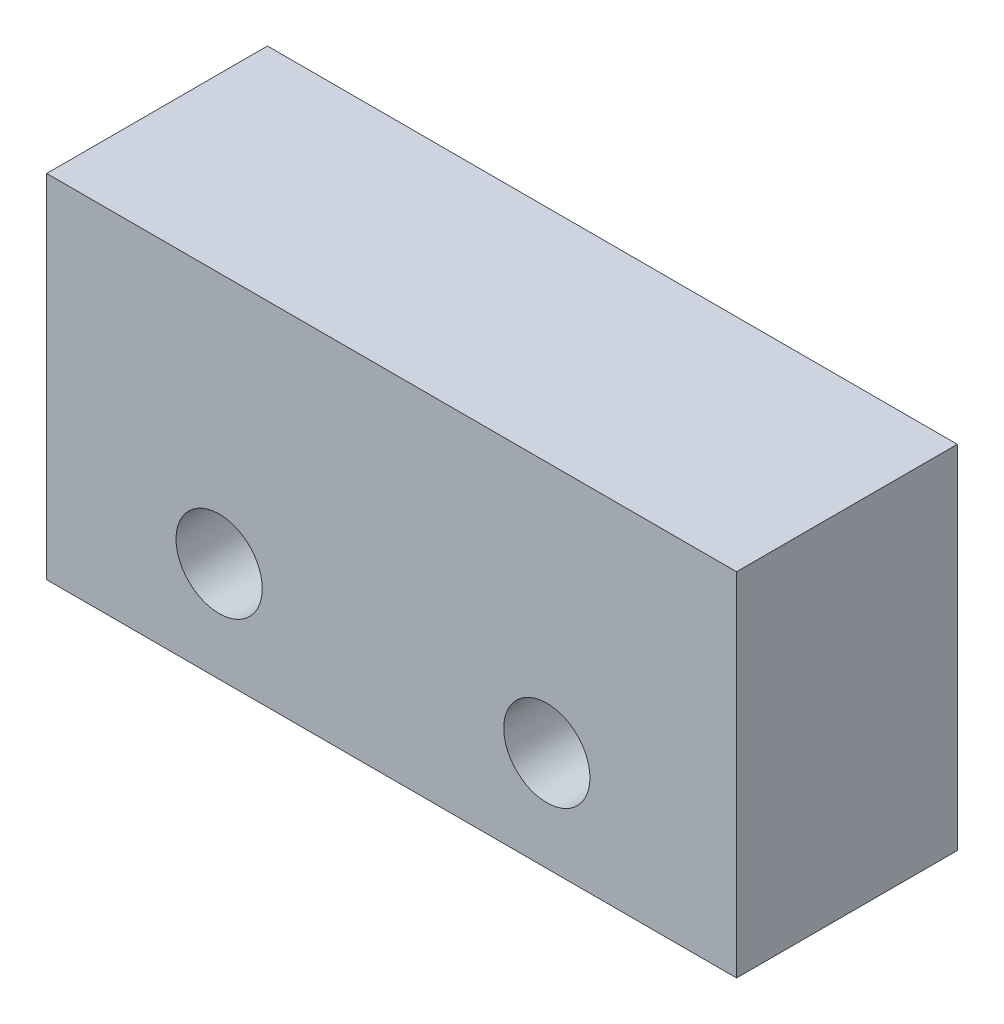
ISO-10303-21;
HEADER;
FILE_DESCRIPTION(('STEP AP214'),'2;1');
FILE_NAME('part.step','',(''),(''),'','','');
FILE_SCHEMA(('AUTOMOTIVE_DESIGN { 1 0 10303 214 1 1 1 1 }'));
ENDSEC;
DATA;
#1=APPLICATION_CONTEXT('core data for automotive mechanical design processes');
#2=APPLICATION_PROTOCOL_DEFINITION('international standard','automotive_design',2000,#1);
#3=PRODUCT_CONTEXT('',#1,'mechanical');
#4=PRODUCT('Part','Part','',(#3));
#5=PRODUCT_RELATED_PRODUCT_CATEGORY('part','',(#4));
#6=PRODUCT_DEFINITION_FORMATION('','',#4);
#7=PRODUCT_DEFINITION_CONTEXT('part definition',#1,'design');
#8=PRODUCT_DEFINITION('design','',#6,#7);
#9=PRODUCT_DEFINITION_SHAPE('','',#8);
#10=(LENGTH_UNIT() NAMED_UNIT(*) SI_UNIT(.MILLI.,.METRE.));
#11=(NAMED_UNIT(*) PLANE_ANGLE_UNIT() SI_UNIT($,.RADIAN.));
#12=(NAMED_UNIT(*) SI_UNIT($,.STERADIAN.) SOLID_ANGLE_UNIT());
#13=UNCERTAINTY_MEASURE_WITH_UNIT(LENGTH_MEASURE(1.E-05),#10,'distance_accuracy_value','');
#14=(GEOMETRIC_REPRESENTATION_CONTEXT(3) GLOBAL_UNCERTAINTY_ASSIGNED_CONTEXT((#13)) GLOBAL_UNIT_ASSIGNED_CONTEXT((#10,
#11,#12)) REPRESENTATION_CONTEXT('',''));
#15=CARTESIAN_POINT('',(0.,0.,0.));
#16=DIRECTION('',(0.,0.,1.));
#17=DIRECTION('',(1.,0.,0.));
#18=AXIS2_PLACEMENT_3D('',#15,#16,#17);
#19=CARTESIAN_POINT('',(-10.,-5.1,3.2));
#20=DIRECTION('',(1.,0.,0.));
#21=DIRECTION('',(0.,0.,-1.));
#22=AXIS2_PLACEMENT_3D('',#19,#20,#21);
#23=PLANE('',#22);
#24=DIRECTION('',(0.,-1.,0.));
#25=VECTOR('',#24,1.);
#26=CARTESIAN_POINT('',(-10.,-5.1,-3.2));
#27=LINE('',#26,#25);
#28=CARTESIAN_POINT('',(-10.,5.1,-3.2));
#29=VERTEX_POINT('',#28);
#30=CARTESIAN_POINT('',(-10.,-5.1,-3.2));
#31=VERTEX_POINT('',#30);
#32=EDGE_CURVE('E96',#29,#31,#27,.T.);
#33=ORIENTED_EDGE('',*,*,#32,.T.);
#34=DIRECTION('',(0.,0.,-1.));
#35=VECTOR('',#34,1.);
#36=CARTESIAN_POINT('',(-10.,-5.1,3.2));
#37=LINE('',#36,#35);
#38=CARTESIAN_POINT('',(-10.,-5.1,3.2));
#39=VERTEX_POINT('',#38);
#40=EDGE_CURVE('E11',#39,#31,#37,.T.);
#41=ORIENTED_EDGE('',*,*,#40,.F.);
#42=DIRECTION('',(0.,-1.,0.));
#43=VECTOR('',#42,1.);
#44=CARTESIAN_POINT('',(-10.,-5.1,3.2));
#45=LINE('',#44,#43);
#46=CARTESIAN_POINT('',(-10.,5.1,3.2));
#47=VERTEX_POINT('',#46);
#48=EDGE_CURVE('E84',#47,#39,#45,.T.);
#49=ORIENTED_EDGE('',*,*,#48,.F.);
#50=DIRECTION('',(0.,0.,-1.));
#51=VECTOR('',#50,1.);
#52=CARTESIAN_POINT('',(-10.,5.1,3.2));
#53=LINE('',#52,#51);
#54=EDGE_CURVE('E92',#47,#29,#53,.T.);
#55=ORIENTED_EDGE('',*,*,#54,.T.);
#56=EDGE_LOOP('',(#33,#41,#49,#55));
#57=FACE_BOUND('',#56,.T.);
#58=ADVANCED_FACE('F33',(#57),#23,.F.);
#59=CARTESIAN_POINT('',(10.,-5.1,3.2));
#60=DIRECTION('',(0.,1.,0.));
#61=DIRECTION('',(-1.,0.,0.));
#62=AXIS2_PLACEMENT_3D('',#59,#60,#61);
#63=PLANE('',#62);
#64=DIRECTION('',(1.,0.,0.));
#65=VECTOR('',#64,1.);
#66=CARTESIAN_POINT('',(10.,-5.1,-3.2));
#67=LINE('',#66,#65);
#68=CARTESIAN_POINT('',(10.,-5.1,-3.2));
#69=VERTEX_POINT('',#68);
#70=EDGE_CURVE('E88',#31,#69,#67,.T.);
#71=ORIENTED_EDGE('',*,*,#70,.T.);
#72=DIRECTION('',(0.,0.,-1.));
#73=VECTOR('',#72,1.);
#74=CARTESIAN_POINT('',(10.,-5.1,3.2));
#75=LINE('',#74,#73);
#76=CARTESIAN_POINT('',(10.,-5.1,3.2));
#77=VERTEX_POINT('',#76);
#78=EDGE_CURVE('E41',#77,#69,#75,.T.);
#79=ORIENTED_EDGE('',*,*,#78,.F.);
#80=DIRECTION('',(1.,0.,0.));
#81=VECTOR('',#80,1.);
#82=CARTESIAN_POINT('',(10.,-5.1,3.2));
#83=LINE('',#82,#81);
#84=EDGE_CURVE('E79',#39,#77,#83,.T.);
#85=ORIENTED_EDGE('',*,*,#84,.F.);
#86=ORIENTED_EDGE('',*,*,#40,.T.);
#87=EDGE_LOOP('',(#71,#79,#85,#86));
#88=FACE_BOUND('',#87,.T.);
#89=ADVANCED_FACE('F87',(#88),#63,.F.);
#90=CARTESIAN_POINT('',(10.,-5.1,3.2));
#91=DIRECTION('',(-1.,0.,0.));
#92=DIRECTION('',(0.,0.,1.));
#93=AXIS2_PLACEMENT_3D('',#90,#91,#92);
#94=PLANE('',#93);
#95=DIRECTION('',(0.,1.,0.));
#96=VECTOR('',#95,1.);
#97=CARTESIAN_POINT('',(10.,-5.1,-3.2));
#98=LINE('',#97,#96);
#99=CARTESIAN_POINT('',(10.,5.1,-3.2));
#100=VERTEX_POINT('',#99);
#101=EDGE_CURVE('E66',#69,#100,#98,.T.);
#102=ORIENTED_EDGE('',*,*,#101,.T.);
#103=DIRECTION('',(0.,0.,-1.));
#104=VECTOR('',#103,1.);
#105=CARTESIAN_POINT('',(10.,5.1,3.2));
#106=LINE('',#105,#104);
#107=CARTESIAN_POINT('',(10.,5.1,3.2));
#108=VERTEX_POINT('',#107);
#109=EDGE_CURVE('E89',#108,#100,#106,.T.);
#110=ORIENTED_EDGE('',*,*,#109,.F.);
#111=DIRECTION('',(0.,1.,0.));
#112=VECTOR('',#111,1.);
#113=CARTESIAN_POINT('',(10.,-5.1,3.2));
#114=LINE('',#113,#112);
#115=EDGE_CURVE('E82',#77,#108,#114,.T.);
#116=ORIENTED_EDGE('',*,*,#115,.F.);
#117=ORIENTED_EDGE('',*,*,#78,.T.);
#118=EDGE_LOOP('',(#102,#110,#116,#117));
#119=FACE_BOUND('',#118,.T.);
#120=ADVANCED_FACE('F90',(#119),#94,.F.);
#121=CARTESIAN_POINT('',(10.,5.1,3.2));
#122=DIRECTION('',(0.,-1.,0.));
#123=DIRECTION('',(1.,0.,0.));
#124=AXIS2_PLACEMENT_3D('',#121,#122,#123);
#125=PLANE('',#124);
#126=DIRECTION('',(-1.,0.,0.));
#127=VECTOR('',#126,1.);
#128=CARTESIAN_POINT('',(10.,5.1,-3.2));
#129=LINE('',#128,#127);
#130=EDGE_CURVE('E72',#100,#29,#129,.T.);
#131=ORIENTED_EDGE('',*,*,#130,.T.);
#132=ORIENTED_EDGE('',*,*,#54,.F.);
#133=DIRECTION('',(-1.,0.,0.));
#134=VECTOR('',#133,1.);
#135=CARTESIAN_POINT('',(10.,5.1,3.2));
#136=LINE('',#135,#134);
#137=EDGE_CURVE('E49',#108,#47,#136,.T.);
#138=ORIENTED_EDGE('',*,*,#137,.F.);
#139=ORIENTED_EDGE('',*,*,#109,.T.);
#140=EDGE_LOOP('',(#131,#132,#138,#139));
#141=FACE_BOUND('',#140,.T.);
#142=ADVANCED_FACE('F104',(#141),#125,.F.);
#143=CARTESIAN_POINT('',(0.,0.,3.2));
#144=DIRECTION('',(0.,0.,1.));
#145=DIRECTION('',(1.,0.,0.));
#146=AXIS2_PLACEMENT_3D('',#143,#144,#145);
#147=PLANE('',#146);
#148=CARTESIAN_POINT('',(4.5,-2.2,3.2));
#149=DIRECTION('',(0.,0.,1.));
#150=DIRECTION('',(1.,0.,0.));
#151=AXIS2_PLACEMENT_3D('',#148,#149,#150);
#152=CIRCLE('',#151,1.25);
#153=CARTESIAN_POINT('',(5.75,-2.2,3.2));
#154=VERTEX_POINT('',#153);
#155=EDGE_CURVE('E116',#154,#154,#152,.T.);
#156=ORIENTED_EDGE('',*,*,#155,.F.);
#157=EDGE_LOOP('',(#156));
#158=FACE_BOUND('',#157,.T.);
#159=CARTESIAN_POINT('',(-5.,-2.2,3.2));
#160=DIRECTION('',(0.,0.,1.));
#161=DIRECTION('',(1.,0.,0.));
#162=AXIS2_PLACEMENT_3D('',#159,#160,#161);
#163=CIRCLE('',#162,1.25);
#164=CARTESIAN_POINT('',(-3.75,-2.2,3.2));
#165=VERTEX_POINT('',#164);
#166=EDGE_CURVE('E110',#165,#165,#163,.T.);
#167=ORIENTED_EDGE('',*,*,#166,.F.);
#168=EDGE_LOOP('',(#167));
#169=FACE_BOUND('',#168,.T.);
#170=ORIENTED_EDGE('',*,*,#48,.T.);
#171=ORIENTED_EDGE('',*,*,#84,.T.);
#172=ORIENTED_EDGE('',*,*,#115,.T.);
#173=ORIENTED_EDGE('',*,*,#137,.T.);
#174=EDGE_LOOP('',(#170,#171,#172,#173));
#175=FACE_BOUND('',#174,.T.);
#176=ADVANCED_FACE('F80',(#158,#169,#175),#147,.T.);
#177=CARTESIAN_POINT('',(0.,0.,-3.2));
#178=DIRECTION('',(0.,0.,1.));
#179=DIRECTION('',(1.,0.,0.));
#180=AXIS2_PLACEMENT_3D('',#177,#178,#179);
#181=PLANE('',#180);
#182=CARTESIAN_POINT('',(4.5,-2.2,-3.2));
#183=DIRECTION('',(0.,0.,1.));
#184=DIRECTION('',(1.,0.,0.));
#185=AXIS2_PLACEMENT_3D('',#182,#183,#184);
#186=CIRCLE('',#185,1.25);
#187=CARTESIAN_POINT('',(5.75,-2.2,-3.2));
#188=VERTEX_POINT('',#187);
#189=EDGE_CURVE('E99',#188,#188,#186,.T.);
#190=ORIENTED_EDGE('',*,*,#189,.T.);
#191=EDGE_LOOP('',(#190));
#192=FACE_BOUND('',#191,.T.);
#193=CARTESIAN_POINT('',(-5.,-2.2,-3.2));
#194=DIRECTION('',(0.,0.,1.));
#195=DIRECTION('',(1.,0.,0.));
#196=AXIS2_PLACEMENT_3D('',#193,#194,#195);
#197=CIRCLE('',#196,1.25);
#198=CARTESIAN_POINT('',(-3.75,-2.2,-3.2));
#199=VERTEX_POINT('',#198);
#200=EDGE_CURVE('E113',#199,#199,#197,.T.);
#201=ORIENTED_EDGE('',*,*,#200,.T.);
#202=EDGE_LOOP('',(#201));
#203=FACE_BOUND('',#202,.T.);
#204=ORIENTED_EDGE('',*,*,#32,.F.);
#205=ORIENTED_EDGE('',*,*,#130,.F.);
#206=ORIENTED_EDGE('',*,*,#101,.F.);
#207=ORIENTED_EDGE('',*,*,#70,.F.);
#208=EDGE_LOOP('',(#204,#205,#206,#207));
#209=FACE_BOUND('',#208,.T.);
#210=ADVANCED_FACE('F107',(#192,#203,#209),#181,.F.);
#211=CARTESIAN_POINT('',(-5.,-2.2,-3.2));
#212=DIRECTION('',(0.,0.,1.));
#213=DIRECTION('',(1.,0.,0.));
#214=AXIS2_PLACEMENT_3D('',#211,#212,#213);
#215=CYLINDRICAL_SURFACE('',#214,1.25);
#216=ORIENTED_EDGE('',*,*,#200,.F.);
#217=EDGE_LOOP('',(#216));
#218=FACE_BOUND('',#217,.T.);
#219=ORIENTED_EDGE('',*,*,#166,.T.);
#220=EDGE_LOOP('',(#219));
#221=FACE_BOUND('',#220,.T.);
#222=ADVANCED_FACE('F127',(#218,#221),#215,.F.);
#223=CARTESIAN_POINT('',(4.5,-2.2,-3.2));
#224=DIRECTION('',(0.,0.,1.));
#225=DIRECTION('',(1.,0.,0.));
#226=AXIS2_PLACEMENT_3D('',#223,#224,#225);
#227=CYLINDRICAL_SURFACE('',#226,1.25);
#228=ORIENTED_EDGE('',*,*,#189,.F.);
#229=EDGE_LOOP('',(#228));
#230=FACE_BOUND('',#229,.T.);
#231=ORIENTED_EDGE('',*,*,#155,.T.);
#232=EDGE_LOOP('',(#231));
#233=FACE_BOUND('',#232,.T.);
#234=ADVANCED_FACE('F124',(#230,#233),#227,.F.);
#235=CLOSED_SHELL('',(#58,#89,#120,#142,#176,#210,#222,#234));
#236=MANIFOLD_SOLID_BREP('B2',#235);
#237=ADVANCED_BREP_SHAPE_REPRESENTATION('',(#18,#236),#14);
#238=SHAPE_DEFINITION_REPRESENTATION(#9,#237);
ENDSEC;
END-ISO-10303-21;
